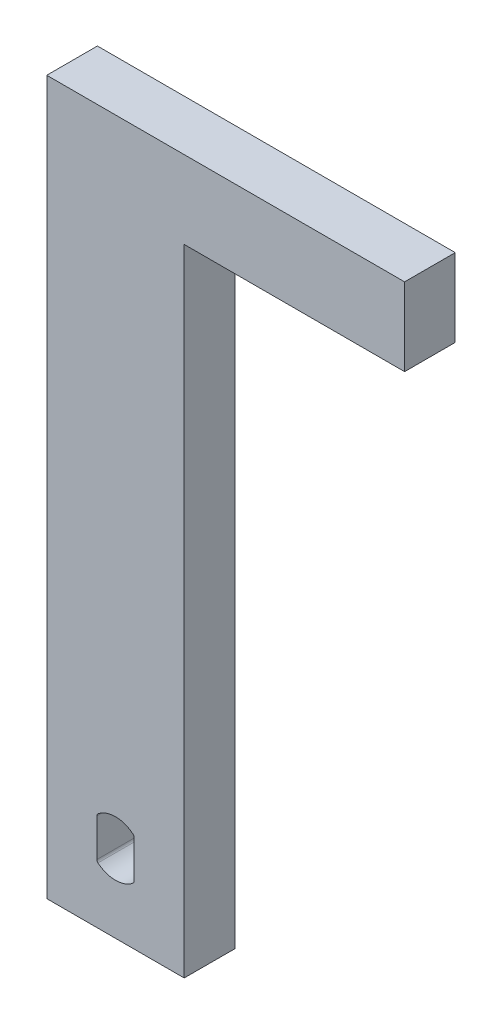
ISO-10303-21;
HEADER;
FILE_DESCRIPTION(('STEP AP214'),'2;1');
FILE_NAME('part.step','',(''),(''),'','','');
FILE_SCHEMA(('AUTOMOTIVE_DESIGN { 1 0 10303 214 1 1 1 1 }'));
ENDSEC;
DATA;
#1=APPLICATION_CONTEXT('core data for automotive mechanical design processes');
#2=APPLICATION_PROTOCOL_DEFINITION('international standard','automotive_design',2000,#1);
#3=PRODUCT_CONTEXT('',#1,'mechanical');
#4=PRODUCT('Part','Part','',(#3));
#5=PRODUCT_RELATED_PRODUCT_CATEGORY('part','',(#4));
#6=PRODUCT_DEFINITION_FORMATION('','',#4);
#7=PRODUCT_DEFINITION_CONTEXT('part definition',#1,'design');
#8=PRODUCT_DEFINITION('design','',#6,#7);
#9=PRODUCT_DEFINITION_SHAPE('','',#8);
#10=(LENGTH_UNIT() NAMED_UNIT(*) SI_UNIT(.MILLI.,.METRE.));
#11=(NAMED_UNIT(*) PLANE_ANGLE_UNIT() SI_UNIT($,.RADIAN.));
#12=(NAMED_UNIT(*) SI_UNIT($,.STERADIAN.) SOLID_ANGLE_UNIT());
#13=UNCERTAINTY_MEASURE_WITH_UNIT(LENGTH_MEASURE(1.E-05),#10,'distance_accuracy_value','');
#14=(GEOMETRIC_REPRESENTATION_CONTEXT(3) GLOBAL_UNCERTAINTY_ASSIGNED_CONTEXT((#13)) GLOBAL_UNIT_ASSIGNED_CONTEXT((#10,
#11,#12)) REPRESENTATION_CONTEXT('',''));
#15=CARTESIAN_POINT('',(0.,0.,0.));
#16=DIRECTION('',(0.,0.,1.));
#17=DIRECTION('',(1.,0.,0.));
#18=AXIS2_PLACEMENT_3D('',#15,#16,#17);
#19=CARTESIAN_POINT('',(6.73099999999999,34.925,4.9609375));
#20=DIRECTION('',(-1.,0.,0.));
#21=DIRECTION('',(0.,-1.,0.));
#22=AXIS2_PLACEMENT_3D('',#19,#20,#21);
#23=PLANE('',#22);
#24=DIRECTION('',(0.,0.,-1.));
#25=VECTOR('',#24,1.);
#26=CARTESIAN_POINT('',(6.731,27.305,4.9609375));
#27=LINE('',#26,#25);
#28=CARTESIAN_POINT('',(6.73099999999999,27.305,4.9609375));
#29=VERTEX_POINT('',#28);
#30=CARTESIAN_POINT('',(6.731,27.305,0.));
#31=VERTEX_POINT('',#30);
#32=EDGE_CURVE('E191',#29,#31,#27,.T.);
#33=ORIENTED_EDGE('',*,*,#32,.F.);
#34=DIRECTION('',(0.,1.,0.));
#35=VECTOR('',#34,1.);
#36=CARTESIAN_POINT('',(6.73099999999999,34.925,4.9609375));
#37=LINE('',#36,#35);
#38=CARTESIAN_POINT('',(6.731,-34.925,4.9609375));
#39=VERTEX_POINT('',#38);
#40=EDGE_CURVE('E223',#39,#29,#37,.T.);
#41=ORIENTED_EDGE('',*,*,#40,.F.);
#42=DIRECTION('',(0.,0.,-1.));
#43=VECTOR('',#42,1.);
#44=CARTESIAN_POINT('',(6.731,-34.925,4.9609375));
#45=LINE('',#44,#43);
#46=CARTESIAN_POINT('',(6.731,-34.925,0.));
#47=VERTEX_POINT('',#46);
#48=EDGE_CURVE('E233',#39,#47,#45,.T.);
#49=ORIENTED_EDGE('',*,*,#48,.T.);
#50=DIRECTION('',(0.,1.,0.));
#51=VECTOR('',#50,1.);
#52=CARTESIAN_POINT('',(6.73099999999999,34.925,0.));
#53=LINE('',#52,#51);
#54=EDGE_CURVE('E222',#47,#31,#53,.T.);
#55=ORIENTED_EDGE('',*,*,#54,.T.);
#56=EDGE_LOOP('',(#33,#41,#49,#55));
#57=FACE_BOUND('',#56,.T.);
#58=ADVANCED_FACE('F34',(#57),#23,.F.);
#59=CARTESIAN_POINT('',(-6.73100000000001,34.925,4.9609375));
#60=DIRECTION('',(0.,-1.,0.));
#61=DIRECTION('',(0.,0.,-1.));
#62=AXIS2_PLACEMENT_3D('',#59,#60,#61);
#63=PLANE('',#62);
#64=DIRECTION('',(-1.,0.,0.));
#65=VECTOR('',#64,1.);
#66=CARTESIAN_POINT('',(-6.73100000000001,34.925,0.));
#67=LINE('',#66,#65);
#68=CARTESIAN_POINT('',(28.321,34.925,0.));
#69=VERTEX_POINT('',#68);
#70=CARTESIAN_POINT('',(-6.73100000000001,34.925,0.));
#71=VERTEX_POINT('',#70);
#72=EDGE_CURVE('E235',#69,#71,#67,.T.);
#73=ORIENTED_EDGE('',*,*,#72,.T.);
#74=DIRECTION('',(0.,0.,-1.));
#75=VECTOR('',#74,1.);
#76=CARTESIAN_POINT('',(-6.73100000000001,34.925,4.9609375));
#77=LINE('',#76,#75);
#78=CARTESIAN_POINT('',(-6.73100000000001,34.925,4.9609375));
#79=VERTEX_POINT('',#78);
#80=EDGE_CURVE('E12',#79,#71,#77,.T.);
#81=ORIENTED_EDGE('',*,*,#80,.F.);
#82=DIRECTION('',(-1.,0.,0.));
#83=VECTOR('',#82,1.);
#84=CARTESIAN_POINT('',(-6.73100000000001,34.925,4.9609375));
#85=LINE('',#84,#83);
#86=CARTESIAN_POINT('',(28.321,34.925,4.9609375));
#87=VERTEX_POINT('',#86);
#88=EDGE_CURVE('E226',#87,#79,#85,.T.);
#89=ORIENTED_EDGE('',*,*,#88,.F.);
#90=DIRECTION('',(0.,0.,1.));
#91=VECTOR('',#90,1.);
#92=CARTESIAN_POINT('',(28.321,34.925,4.9609375));
#93=LINE('',#92,#91);
#94=EDGE_CURVE('E211',#69,#87,#93,.T.);
#95=ORIENTED_EDGE('',*,*,#94,.F.);
#96=EDGE_LOOP('',(#73,#81,#89,#95));
#97=FACE_BOUND('',#96,.T.);
#98=ADVANCED_FACE('F265',(#97),#63,.F.);
#99=CARTESIAN_POINT('',(-6.73100000000001,34.925,4.9609375));
#100=DIRECTION('',(1.,0.,0.));
#101=DIRECTION('',(0.,1.,0.));
#102=AXIS2_PLACEMENT_3D('',#99,#100,#101);
#103=PLANE('',#102);
#104=DIRECTION('',(0.,-1.,0.));
#105=VECTOR('',#104,1.);
#106=CARTESIAN_POINT('',(-6.73100000000001,34.925,0.));
#107=LINE('',#106,#105);
#108=CARTESIAN_POINT('',(-6.731,-34.925,0.));
#109=VERTEX_POINT('',#108);
#110=EDGE_CURVE('E237',#71,#109,#107,.T.);
#111=ORIENTED_EDGE('',*,*,#110,.T.);
#112=DIRECTION('',(0.,0.,-1.));
#113=VECTOR('',#112,1.);
#114=CARTESIAN_POINT('',(-6.731,-34.925,4.9609375));
#115=LINE('',#114,#113);
#116=CARTESIAN_POINT('',(-6.731,-34.925,4.9609375));
#117=VERTEX_POINT('',#116);
#118=EDGE_CURVE('E41',#117,#109,#115,.T.);
#119=ORIENTED_EDGE('',*,*,#118,.F.);
#120=DIRECTION('',(0.,-1.,0.));
#121=VECTOR('',#120,1.);
#122=CARTESIAN_POINT('',(-6.73100000000001,34.925,4.9609375));
#123=LINE('',#122,#121);
#124=EDGE_CURVE('E229',#79,#117,#123,.T.);
#125=ORIENTED_EDGE('',*,*,#124,.F.);
#126=ORIENTED_EDGE('',*,*,#80,.T.);
#127=EDGE_LOOP('',(#111,#119,#125,#126));
#128=FACE_BOUND('',#127,.T.);
#129=ADVANCED_FACE('F263',(#128),#103,.F.);
#130=CARTESIAN_POINT('',(-6.731,-34.925,4.9609375));
#131=DIRECTION('',(0.,1.,0.));
#132=DIRECTION('',(0.,0.,1.));
#133=AXIS2_PLACEMENT_3D('',#130,#131,#132);
#134=PLANE('',#133);
#135=DIRECTION('',(1.,0.,0.));
#136=VECTOR('',#135,1.);
#137=CARTESIAN_POINT('',(-6.731,-34.925,0.));
#138=LINE('',#137,#136);
#139=EDGE_CURVE('E227',#109,#47,#138,.T.);
#140=ORIENTED_EDGE('',*,*,#139,.T.);
#141=ORIENTED_EDGE('',*,*,#48,.F.);
#142=DIRECTION('',(1.,0.,0.));
#143=VECTOR('',#142,1.);
#144=CARTESIAN_POINT('',(-6.731,-34.925,4.9609375));
#145=LINE('',#144,#143);
#146=EDGE_CURVE('E231',#117,#39,#145,.T.);
#147=ORIENTED_EDGE('',*,*,#146,.F.);
#148=ORIENTED_EDGE('',*,*,#118,.T.);
#149=EDGE_LOOP('',(#140,#141,#147,#148));
#150=FACE_BOUND('',#149,.T.);
#151=ADVANCED_FACE('F246',(#150),#134,.F.);
#152=CARTESIAN_POINT('',(0.,0.,4.9609375));
#153=DIRECTION('',(0.,0.,1.));
#154=DIRECTION('',(1.,0.,0.));
#155=AXIS2_PLACEMENT_3D('',#152,#153,#154);
#156=PLANE('',#155);
#157=CARTESIAN_POINT('',(-1.52499999999997,-29.1577867443894,4.9609375));
#158=DIRECTION('',(0.,0.,1.));
#159=DIRECTION('',(1.,0.,0.));
#160=AXIS2_PLACEMENT_3D('',#157,#158,#159);
#161=CIRCLE('',#160,0.299999999999899);
#162=CARTESIAN_POINT('',(-1.82499999999981,-29.1577867443891,4.9609375));
#163=VERTEX_POINT('',#162);
#164=CARTESIAN_POINT('',(-1.71562500000001,-29.3894375794299,4.9609375));
#165=VERTEX_POINT('',#164);
#166=EDGE_CURVE('E48',#163,#165,#161,.T.);
#167=ORIENTED_EDGE('',*,*,#166,.F.);
#168=DIRECTION('',(0.,-1.,0.));
#169=VECTOR('',#168,1.);
#170=CARTESIAN_POINT('',(-1.82499999999981,-29.1577867443891,4.9609375));
#171=LINE('',#170,#169);
#172=CARTESIAN_POINT('',(-1.82499999999981,-25.4513733837397,4.9609375));
#173=VERTEX_POINT('',#172);
#174=EDGE_CURVE('E153',#173,#163,#171,.T.);
#175=ORIENTED_EDGE('',*,*,#174,.F.);
#176=CARTESIAN_POINT('',(-1.52500000000027,-25.45137338374,4.9609375));
#177=DIRECTION('',(0.,0.,1.));
#178=DIRECTION('',(1.,0.,0.));
#179=AXIS2_PLACEMENT_3D('',#176,#177,#178);
#180=CIRCLE('',#179,0.299999999999684);
#181=CARTESIAN_POINT('',(-1.71562499999979,-25.2197225486995,4.9609375));
#182=VERTEX_POINT('',#181);
#183=EDGE_CURVE('E156',#182,#173,#180,.T.);
#184=ORIENTED_EDGE('',*,*,#183,.F.);
#185=CARTESIAN_POINT('',(0.,-27.3045800640647,4.9609375));
#186=DIRECTION('',(0.,0.,1.));
#187=DIRECTION('',(1.,0.,0.));
#188=AXIS2_PLACEMENT_3D('',#185,#186,#187);
#189=CIRCLE('',#188,2.7);
#190=CARTESIAN_POINT('',(1.71562499999994,-25.2197225486993,4.9609375));
#191=VERTEX_POINT('',#190);
#192=EDGE_CURVE('E184',#191,#182,#189,.T.);
#193=ORIENTED_EDGE('',*,*,#192,.F.);
#194=CARTESIAN_POINT('',(1.52499999999986,-25.45137338374,4.9609375));
#195=DIRECTION('',(0.,0.,1.));
#196=DIRECTION('',(1.,0.,0.));
#197=AXIS2_PLACEMENT_3D('',#194,#195,#196);
#198=CIRCLE('',#197,0.300000000000252);
#199=CARTESIAN_POINT('',(1.82500000000012,-25.4513733837406,4.9609375));
#200=VERTEX_POINT('',#199);
#201=EDGE_CURVE('E181',#200,#191,#198,.T.);
#202=ORIENTED_EDGE('',*,*,#201,.F.);
#203=DIRECTION('',(0.,1.,0.));
#204=VECTOR('',#203,1.);
#205=CARTESIAN_POINT('',(1.82500000000027,-25.4513733837406,4.9609375));
#206=LINE('',#205,#204);
#207=CARTESIAN_POINT('',(1.82500000000027,-29.1577867443888,4.9609375));
#208=VERTEX_POINT('',#207);
#209=EDGE_CURVE('E178',#208,#200,#206,.T.);
#210=ORIENTED_EDGE('',*,*,#209,.F.);
#211=CARTESIAN_POINT('',(1.52500000000003,-29.1577867443894,4.9609375));
#212=DIRECTION('',(0.,0.,1.));
#213=DIRECTION('',(1.,0.,0.));
#214=AXIS2_PLACEMENT_3D('',#211,#212,#213);
#215=CIRCLE('',#214,0.300000000000115);
#216=CARTESIAN_POINT('',(1.71562500000015,-29.38943757943,4.9609375));
#217=VERTEX_POINT('',#216);
#218=EDGE_CURVE('E175',#217,#208,#215,.T.);
#219=ORIENTED_EDGE('',*,*,#218,.F.);
#220=CARTESIAN_POINT('',(0.,-27.3045800640647,4.9609375));
#221=DIRECTION('',(0.,0.,1.));
#222=DIRECTION('',(1.,0.,0.));
#223=AXIS2_PLACEMENT_3D('',#220,#221,#222);
#224=CIRCLE('',#223,2.69999999999998);
#225=EDGE_CURVE('E173',#165,#217,#224,.T.);
#226=ORIENTED_EDGE('',*,*,#225,.F.);
#227=EDGE_LOOP('',(#167,#175,#184,#193,#202,#210,#219,#226));
#228=FACE_BOUND('',#227,.T.);
#229=ORIENTED_EDGE('',*,*,#40,.T.);
#230=DIRECTION('',(-1.,0.,0.));
#231=VECTOR('',#230,1.);
#232=CARTESIAN_POINT('',(28.321,27.305,4.9609375));
#233=LINE('',#232,#231);
#234=CARTESIAN_POINT('',(28.321,27.305,4.9609375));
#235=VERTEX_POINT('',#234);
#236=EDGE_CURVE('E219',#235,#29,#233,.T.);
#237=ORIENTED_EDGE('',*,*,#236,.F.);
#238=DIRECTION('',(0.,-1.,0.));
#239=VECTOR('',#238,1.);
#240=CARTESIAN_POINT('',(28.321,34.925,4.9609375));
#241=LINE('',#240,#239);
#242=EDGE_CURVE('E203',#87,#235,#241,.T.);
#243=ORIENTED_EDGE('',*,*,#242,.F.);
#244=ORIENTED_EDGE('',*,*,#88,.T.);
#245=ORIENTED_EDGE('',*,*,#124,.T.);
#246=ORIENTED_EDGE('',*,*,#146,.T.);
#247=EDGE_LOOP('',(#229,#237,#243,#244,#245,#246));
#248=FACE_BOUND('',#247,.T.);
#249=ADVANCED_FACE('F261',(#228,#248),#156,.T.);
#250=CARTESIAN_POINT('',(0.,0.,0.));
#251=DIRECTION('',(0.,0.,1.));
#252=DIRECTION('',(1.,0.,0.));
#253=AXIS2_PLACEMENT_3D('',#250,#251,#252);
#254=PLANE('',#253);
#255=DIRECTION('',(0.,-1.,0.));
#256=VECTOR('',#255,1.);
#257=CARTESIAN_POINT('',(-1.82499999999981,-29.1577867443891,0.));
#258=LINE('',#257,#256);
#259=CARTESIAN_POINT('',(-1.82499999999981,-25.4513733837397,0.));
#260=VERTEX_POINT('',#259);
#261=CARTESIAN_POINT('',(-1.82499999999981,-29.1577867443891,0.));
#262=VERTEX_POINT('',#261);
#263=EDGE_CURVE('E142',#260,#262,#258,.T.);
#264=ORIENTED_EDGE('',*,*,#263,.T.);
#265=CARTESIAN_POINT('',(-1.52499999999997,-29.1577867443894,0.));
#266=DIRECTION('',(0.,0.,1.));
#267=DIRECTION('',(1.,0.,0.));
#268=AXIS2_PLACEMENT_3D('',#265,#266,#267);
#269=CIRCLE('',#268,0.299999999999899);
#270=CARTESIAN_POINT('',(-1.71562500000001,-29.3894375794299,0.));
#271=VERTEX_POINT('',#270);
#272=EDGE_CURVE('E136',#262,#271,#269,.T.);
#273=ORIENTED_EDGE('',*,*,#272,.T.);
#274=CARTESIAN_POINT('',(0.,-27.3045800640647,0.));
#275=DIRECTION('',(0.,0.,1.));
#276=DIRECTION('',(1.,0.,0.));
#277=AXIS2_PLACEMENT_3D('',#274,#275,#276);
#278=CIRCLE('',#277,2.69999999999998);
#279=CARTESIAN_POINT('',(1.71562500000006,-29.3894375794299,0.));
#280=VERTEX_POINT('',#279);
#281=EDGE_CURVE('E145',#271,#280,#278,.T.);
#282=ORIENTED_EDGE('',*,*,#281,.T.);
#283=CARTESIAN_POINT('',(1.52500000000003,-29.1577867443894,0.));
#284=DIRECTION('',(0.,0.,1.));
#285=DIRECTION('',(1.,0.,0.));
#286=AXIS2_PLACEMENT_3D('',#283,#284,#285);
#287=CIRCLE('',#286,0.300000000000115);
#288=CARTESIAN_POINT('',(1.82500000000027,-29.1577867443888,0.));
#289=VERTEX_POINT('',#288);
#290=EDGE_CURVE('E56',#280,#289,#287,.T.);
#291=ORIENTED_EDGE('',*,*,#290,.T.);
#292=DIRECTION('',(0.,1.,0.));
#293=VECTOR('',#292,1.);
#294=CARTESIAN_POINT('',(1.82500000000027,-25.4513733837406,0.));
#295=LINE('',#294,#293);
#296=CARTESIAN_POINT('',(1.82500000000012,-25.4513733837406,0.));
#297=VERTEX_POINT('',#296);
#298=EDGE_CURVE('E160',#289,#297,#295,.T.);
#299=ORIENTED_EDGE('',*,*,#298,.T.);
#300=CARTESIAN_POINT('',(1.52499999999986,-25.45137338374,0.));
#301=DIRECTION('',(0.,0.,1.));
#302=DIRECTION('',(1.,0.,0.));
#303=AXIS2_PLACEMENT_3D('',#300,#301,#302);
#304=CIRCLE('',#303,0.300000000000252);
#305=CARTESIAN_POINT('',(1.71562499999994,-25.2197225486993,0.));
#306=VERTEX_POINT('',#305);
#307=EDGE_CURVE('E163',#297,#306,#304,.T.);
#308=ORIENTED_EDGE('',*,*,#307,.T.);
#309=CARTESIAN_POINT('',(0.,-27.3045800640647,0.));
#310=DIRECTION('',(0.,0.,1.));
#311=DIRECTION('',(1.,0.,0.));
#312=AXIS2_PLACEMENT_3D('',#309,#310,#311);
#313=CIRCLE('',#312,2.7);
#314=CARTESIAN_POINT('',(-1.71562499999979,-25.2197225486995,0.));
#315=VERTEX_POINT('',#314);
#316=EDGE_CURVE('E166',#306,#315,#313,.T.);
#317=ORIENTED_EDGE('',*,*,#316,.T.);
#318=CARTESIAN_POINT('',(-1.52500000000027,-25.45137338374,0.));
#319=DIRECTION('',(0.,0.,1.));
#320=DIRECTION('',(1.,0.,0.));
#321=AXIS2_PLACEMENT_3D('',#318,#319,#320);
#322=CIRCLE('',#321,0.299999999999684);
#323=EDGE_CURVE('E169',#315,#260,#322,.T.);
#324=ORIENTED_EDGE('',*,*,#323,.T.);
#325=EDGE_LOOP('',(#264,#273,#282,#291,#299,#308,#317,#324));
#326=FACE_BOUND('',#325,.T.);
#327=ORIENTED_EDGE('',*,*,#54,.F.);
#328=ORIENTED_EDGE('',*,*,#139,.F.);
#329=ORIENTED_EDGE('',*,*,#110,.F.);
#330=ORIENTED_EDGE('',*,*,#72,.F.);
#331=DIRECTION('',(0.,1.,0.));
#332=VECTOR('',#331,1.);
#333=CARTESIAN_POINT('',(28.321,34.925,0.));
#334=LINE('',#333,#332);
#335=CARTESIAN_POINT('',(28.321,27.305,0.));
#336=VERTEX_POINT('',#335);
#337=EDGE_CURVE('E208',#336,#69,#334,.T.);
#338=ORIENTED_EDGE('',*,*,#337,.F.);
#339=DIRECTION('',(-1.,0.,0.));
#340=VECTOR('',#339,1.);
#341=CARTESIAN_POINT('',(28.321,27.305,0.));
#342=LINE('',#341,#340);
#343=EDGE_CURVE('E214',#336,#31,#342,.T.);
#344=ORIENTED_EDGE('',*,*,#343,.T.);
#345=EDGE_LOOP('',(#327,#328,#329,#330,#338,#344));
#346=FACE_BOUND('',#345,.T.);
#347=ADVANCED_FACE('F149',(#326,#346),#254,.F.);
#348=CARTESIAN_POINT('',(28.321,27.305,4.9609375));
#349=DIRECTION('',(0.,1.,0.));
#350=DIRECTION('',(0.,0.,1.));
#351=AXIS2_PLACEMENT_3D('',#348,#349,#350);
#352=PLANE('',#351);
#353=ORIENTED_EDGE('',*,*,#32,.T.);
#354=ORIENTED_EDGE('',*,*,#343,.F.);
#355=DIRECTION('',(0.,0.,-1.));
#356=VECTOR('',#355,1.);
#357=CARTESIAN_POINT('',(28.321,27.305,4.9609375));
#358=LINE('',#357,#356);
#359=EDGE_CURVE('E206',#235,#336,#358,.T.);
#360=ORIENTED_EDGE('',*,*,#359,.F.);
#361=ORIENTED_EDGE('',*,*,#236,.T.);
#362=EDGE_LOOP('',(#353,#354,#360,#361));
#363=FACE_BOUND('',#362,.T.);
#364=ADVANCED_FACE('F257',(#363),#352,.F.);
#365=CARTESIAN_POINT('',(28.321,0.,0.));
#366=DIRECTION('',(1.,0.,0.));
#367=DIRECTION('',(0.,1.,0.));
#368=AXIS2_PLACEMENT_3D('',#365,#366,#367);
#369=PLANE('',#368);
#370=ORIENTED_EDGE('',*,*,#242,.T.);
#371=ORIENTED_EDGE('',*,*,#359,.T.);
#372=ORIENTED_EDGE('',*,*,#337,.T.);
#373=ORIENTED_EDGE('',*,*,#94,.T.);
#374=EDGE_LOOP('',(#370,#371,#372,#373));
#375=FACE_BOUND('',#374,.T.);
#376=ADVANCED_FACE('F268',(#375),#369,.T.);
#377=CARTESIAN_POINT('',(-1.52499999999997,-29.1577867443894,0.));
#378=DIRECTION('',(0.,0.,1.));
#379=DIRECTION('',(1.,0.,0.));
#380=AXIS2_PLACEMENT_3D('',#377,#378,#379);
#381=CYLINDRICAL_SURFACE('',#380,0.299999999999899);
#382=ORIENTED_EDGE('',*,*,#166,.T.);
#383=DIRECTION('',(0.,0.,1.));
#384=VECTOR('',#383,1.);
#385=CARTESIAN_POINT('',(-1.71562500000001,-29.3894375794299,0.));
#386=LINE('',#385,#384);
#387=EDGE_CURVE('E132',#271,#165,#386,.T.);
#388=ORIENTED_EDGE('',*,*,#387,.F.);
#389=ORIENTED_EDGE('',*,*,#272,.F.);
#390=DIRECTION('',(0.,0.,1.));
#391=VECTOR('',#390,1.);
#392=CARTESIAN_POINT('',(-1.82499999999981,-29.1577867443891,0.));
#393=LINE('',#392,#391);
#394=EDGE_CURVE('E189',#262,#163,#393,.T.);
#395=ORIENTED_EDGE('',*,*,#394,.T.);
#396=EDGE_LOOP('',(#382,#388,#389,#395));
#397=FACE_BOUND('',#396,.T.);
#398=ADVANCED_FACE('F134',(#397),#381,.F.);
#399=CARTESIAN_POINT('',(-1.82499999999981,-29.1577867443891,0.));
#400=DIRECTION('',(-1.,0.,0.));
#401=DIRECTION('',(0.,-1.,0.));
#402=AXIS2_PLACEMENT_3D('',#399,#400,#401);
#403=PLANE('',#402);
#404=ORIENTED_EDGE('',*,*,#174,.T.);
#405=ORIENTED_EDGE('',*,*,#394,.F.);
#406=ORIENTED_EDGE('',*,*,#263,.F.);
#407=DIRECTION('',(0.,0.,1.));
#408=VECTOR('',#407,1.);
#409=CARTESIAN_POINT('',(-1.82499999999981,-25.4513733837397,0.));
#410=LINE('',#409,#408);
#411=EDGE_CURVE('E192',#260,#173,#410,.T.);
#412=ORIENTED_EDGE('',*,*,#411,.T.);
#413=EDGE_LOOP('',(#404,#405,#406,#412));
#414=FACE_BOUND('',#413,.T.);
#415=ADVANCED_FACE('F275',(#414),#403,.F.);
#416=CARTESIAN_POINT('',(-1.52500000000027,-25.45137338374,0.));
#417=DIRECTION('',(0.,0.,1.));
#418=DIRECTION('',(1.,0.,0.));
#419=AXIS2_PLACEMENT_3D('',#416,#417,#418);
#420=CYLINDRICAL_SURFACE('',#419,0.299999999999684);
#421=ORIENTED_EDGE('',*,*,#183,.T.);
#422=ORIENTED_EDGE('',*,*,#411,.F.);
#423=ORIENTED_EDGE('',*,*,#323,.F.);
#424=DIRECTION('',(0.,0.,1.));
#425=VECTOR('',#424,1.);
#426=CARTESIAN_POINT('',(-1.71562499999979,-25.2197225486995,0.));
#427=LINE('',#426,#425);
#428=EDGE_CURVE('E194',#315,#182,#427,.T.);
#429=ORIENTED_EDGE('',*,*,#428,.T.);
#430=EDGE_LOOP('',(#421,#422,#423,#429));
#431=FACE_BOUND('',#430,.T.);
#432=ADVANCED_FACE('F313',(#431),#420,.F.);
#433=CARTESIAN_POINT('',(0.,-27.3045800640647,0.));
#434=DIRECTION('',(0.,0.,1.));
#435=DIRECTION('',(1.,0.,0.));
#436=AXIS2_PLACEMENT_3D('',#433,#434,#435);
#437=CYLINDRICAL_SURFACE('',#436,2.7);
#438=ORIENTED_EDGE('',*,*,#192,.T.);
#439=ORIENTED_EDGE('',*,*,#428,.F.);
#440=ORIENTED_EDGE('',*,*,#316,.F.);
#441=DIRECTION('',(0.,0.,1.));
#442=VECTOR('',#441,1.);
#443=CARTESIAN_POINT('',(1.71562499999994,-25.2197225486993,0.));
#444=LINE('',#443,#442);
#445=EDGE_CURVE('E196',#306,#191,#444,.T.);
#446=ORIENTED_EDGE('',*,*,#445,.T.);
#447=EDGE_LOOP('',(#438,#439,#440,#446));
#448=FACE_BOUND('',#447,.T.);
#449=ADVANCED_FACE('F310',(#448),#437,.F.);
#450=CARTESIAN_POINT('',(1.52499999999986,-25.45137338374,0.));
#451=DIRECTION('',(0.,0.,1.));
#452=DIRECTION('',(1.,0.,0.));
#453=AXIS2_PLACEMENT_3D('',#450,#451,#452);
#454=CYLINDRICAL_SURFACE('',#453,0.300000000000252);
#455=ORIENTED_EDGE('',*,*,#201,.T.);
#456=ORIENTED_EDGE('',*,*,#445,.F.);
#457=ORIENTED_EDGE('',*,*,#307,.F.);
#458=DIRECTION('',(0.,0.,1.));
#459=VECTOR('',#458,1.);
#460=CARTESIAN_POINT('',(1.82500000000012,-25.4513733837406,0.));
#461=LINE('',#460,#459);
#462=EDGE_CURVE('E198',#297,#200,#461,.T.);
#463=ORIENTED_EDGE('',*,*,#462,.T.);
#464=EDGE_LOOP('',(#455,#456,#457,#463));
#465=FACE_BOUND('',#464,.T.);
#466=ADVANCED_FACE('F307',(#465),#454,.F.);
#467=CARTESIAN_POINT('',(1.82500000000027,-25.4513733837406,0.));
#468=DIRECTION('',(1.,0.,0.));
#469=DIRECTION('',(0.,0.,-1.));
#470=AXIS2_PLACEMENT_3D('',#467,#468,#469);
#471=PLANE('',#470);
#472=ORIENTED_EDGE('',*,*,#209,.T.);
#473=ORIENTED_EDGE('',*,*,#462,.F.);
#474=ORIENTED_EDGE('',*,*,#298,.F.);
#475=DIRECTION('',(0.,0.,1.));
#476=VECTOR('',#475,1.);
#477=CARTESIAN_POINT('',(1.82500000000027,-29.1577867443888,0.));
#478=LINE('',#477,#476);
#479=EDGE_CURVE('E200',#289,#208,#478,.T.);
#480=ORIENTED_EDGE('',*,*,#479,.T.);
#481=EDGE_LOOP('',(#472,#473,#474,#480));
#482=FACE_BOUND('',#481,.T.);
#483=ADVANCED_FACE('F303',(#482),#471,.F.);
#484=CARTESIAN_POINT('',(1.52500000000003,-29.1577867443894,0.));
#485=DIRECTION('',(0.,0.,1.));
#486=DIRECTION('',(1.,0.,0.));
#487=AXIS2_PLACEMENT_3D('',#484,#485,#486);
#488=CYLINDRICAL_SURFACE('',#487,0.300000000000115);
#489=ORIENTED_EDGE('',*,*,#218,.T.);
#490=ORIENTED_EDGE('',*,*,#479,.F.);
#491=ORIENTED_EDGE('',*,*,#290,.F.);
#492=DIRECTION('',(0.,0.,1.));
#493=VECTOR('',#492,1.);
#494=CARTESIAN_POINT('',(1.71562500000015,-29.38943757943,0.));
#495=LINE('',#494,#493);
#496=EDGE_CURVE('E141',#280,#217,#495,.T.);
#497=ORIENTED_EDGE('',*,*,#496,.T.);
#498=EDGE_LOOP('',(#489,#490,#491,#497));
#499=FACE_BOUND('',#498,.T.);
#500=ADVANCED_FACE('F300',(#499),#488,.F.);
#501=CARTESIAN_POINT('',(0.,-27.3045800640647,0.));
#502=DIRECTION('',(0.,0.,1.));
#503=DIRECTION('',(1.,0.,0.));
#504=AXIS2_PLACEMENT_3D('',#501,#502,#503);
#505=CYLINDRICAL_SURFACE('',#504,2.69999999999998);
#506=ORIENTED_EDGE('',*,*,#225,.T.);
#507=ORIENTED_EDGE('',*,*,#496,.F.);
#508=ORIENTED_EDGE('',*,*,#281,.F.);
#509=ORIENTED_EDGE('',*,*,#387,.T.);
#510=EDGE_LOOP('',(#506,#507,#508,#509));
#511=FACE_BOUND('',#510,.T.);
#512=ADVANCED_FACE('F146',(#511),#505,.F.);
#513=CLOSED_SHELL('',(#58,#98,#129,#151,#249,#347,#364,#376,#398,#415,#432,#449,#466,#483,#500,#512));
#514=MANIFOLD_SOLID_BREP('B2',#513);
#515=ADVANCED_BREP_SHAPE_REPRESENTATION('',(#18,#514),#14);
#516=SHAPE_DEFINITION_REPRESENTATION(#9,#515);
ENDSEC;
END-ISO-10303-21;
